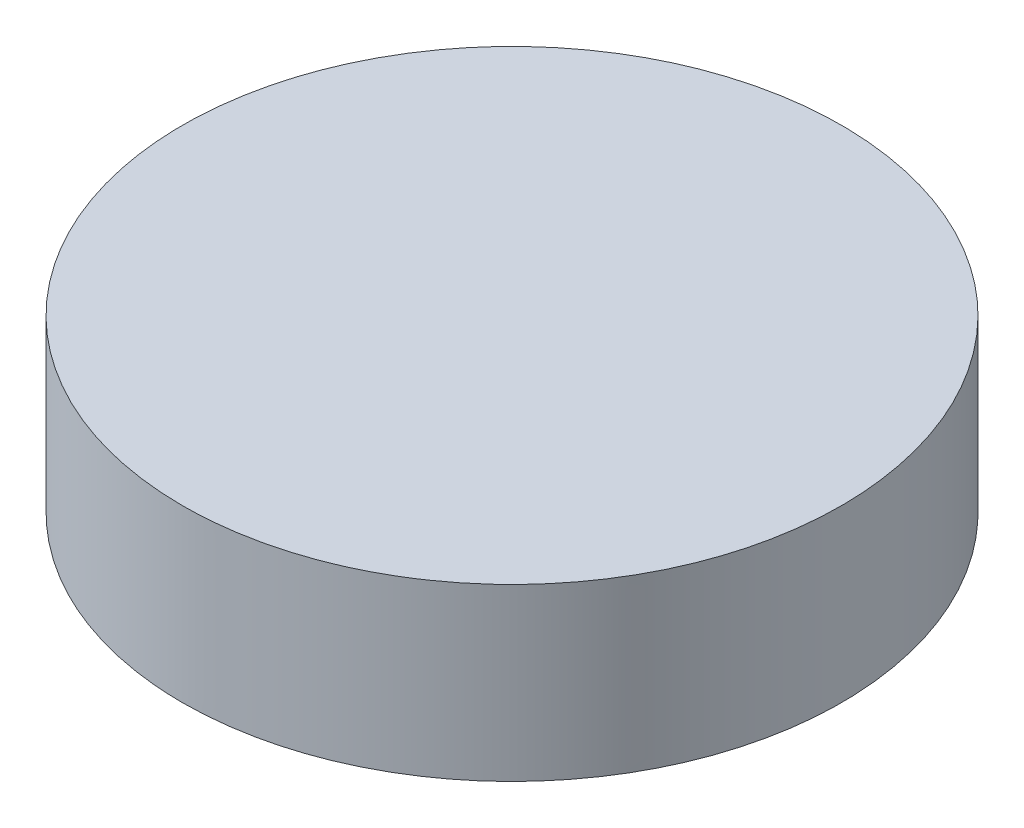
ISO-10303-21;
HEADER;
FILE_DESCRIPTION(('STEP AP214'),'2;1');
FILE_NAME('part.step','',(''),(''),'','','');
FILE_SCHEMA(('AUTOMOTIVE_DESIGN { 1 0 10303 214 1 1 1 1 }'));
ENDSEC;
DATA;
#1=APPLICATION_CONTEXT('core data for automotive mechanical design processes');
#2=APPLICATION_PROTOCOL_DEFINITION('international standard','automotive_design',2000,#1);
#3=PRODUCT_CONTEXT('',#1,'mechanical');
#4=PRODUCT('Part','Part','',(#3));
#5=PRODUCT_RELATED_PRODUCT_CATEGORY('part','',(#4));
#6=PRODUCT_DEFINITION_FORMATION('','',#4);
#7=PRODUCT_DEFINITION_CONTEXT('part definition',#1,'design');
#8=PRODUCT_DEFINITION('design','',#6,#7);
#9=PRODUCT_DEFINITION_SHAPE('','',#8);
#10=(LENGTH_UNIT() NAMED_UNIT(*) SI_UNIT(.MILLI.,.METRE.));
#11=(NAMED_UNIT(*) PLANE_ANGLE_UNIT() SI_UNIT($,.RADIAN.));
#12=(NAMED_UNIT(*) SI_UNIT($,.STERADIAN.) SOLID_ANGLE_UNIT());
#13=UNCERTAINTY_MEASURE_WITH_UNIT(LENGTH_MEASURE(1.E-05),#10,'distance_accuracy_value','');
#14=(GEOMETRIC_REPRESENTATION_CONTEXT(3) GLOBAL_UNCERTAINTY_ASSIGNED_CONTEXT((#13)) GLOBAL_UNIT_ASSIGNED_CONTEXT((#10,
#11,#12)) REPRESENTATION_CONTEXT('',''));
#15=CARTESIAN_POINT('',(0.,0.,0.));
#16=DIRECTION('',(0.,0.,1.));
#17=DIRECTION('',(1.,0.,0.));
#18=AXIS2_PLACEMENT_3D('',#15,#16,#17);
#19=CARTESIAN_POINT('',(-12.5,-2.7666312331574,1.28535533905933));
#20=CARTESIAN_POINT('',(-12.3317700207924,-2.7666312331574,1.28535533905933));
#21=CARTESIAN_POINT('',(-11.9953100623771,-2.7666312331574,1.21842929220248));
#22=CARTESIAN_POINT('',(-11.5674545927316,-2.7666312331574,0.932545407268426));
#23=CARTESIAN_POINT('',(-11.2815707077975,-2.7666312331574,0.504689937622919));
#24=CARTESIAN_POINT('',(-11.1811816375122,-2.7666312331574,0.));
#25=CARTESIAN_POINT('',(-11.2815707077975,-2.7666312331574,-0.504689937622919));
#26=CARTESIAN_POINT('',(-11.5674545927316,-2.7666312331574,-0.932545407268426));
#27=CARTESIAN_POINT('',(-11.9953100623771,-2.7666312331574,-1.21842929220248));
#28=CARTESIAN_POINT('',(-12.5,-2.7666312331574,-1.31881836248775));
#29=CARTESIAN_POINT('',(-13.0046899376229,-2.7666312331574,-1.21842929220248));
#30=CARTESIAN_POINT('',(-13.4325454072684,-2.7666312331574,-0.932545407268426));
#31=CARTESIAN_POINT('',(-13.7184292922025,-2.7666312331574,-0.50468993762292));
#32=CARTESIAN_POINT('',(-13.8188183624877,-2.7666312331574,0.));
#33=CARTESIAN_POINT('',(-13.7184292922025,-2.7666312331574,0.504689937622919));
#34=CARTESIAN_POINT('',(-13.4325454072684,-2.7666312331574,0.932545407268426));
#35=CARTESIAN_POINT('',(-13.0046899376229,-2.7666312331574,1.21842929220248));
#36=CARTESIAN_POINT('',(-12.6682299792076,-2.7666312331574,1.28535533905933));
#37=CARTESIAN_POINT('',(-12.5,-2.7666312331574,1.28535533905933));
#38=B_SPLINE_CURVE_WITH_KNOTS('',3,(#19,#20,#21,#22,#23,#24,#25,#26,#27,#28,#29,#30,#31,#32,#33,
#34,#35,#36,#37),.UNSPECIFIED.,.T.,.F.,(4,1,1,1,1,1,1,1,1,1,1,1,1,1,1,1,4),(0.,
0.0625000000000001,0.125,0.1875,0.25,0.3125,0.375,0.4375,0.5,0.5625,0.625,0.6875,0.75,0.8125,
0.875,0.9375,1.),.UNSPECIFIED.);
#39=DIRECTION('',(0.,1.,0.));
#40=VECTOR('',#39,1.);
#41=SURFACE_OF_LINEAR_EXTRUSION('',#38,#40);
#42=CARTESIAN_POINT('',(-12.5,-2.7666312331574,1.28535533905933));
#43=CARTESIAN_POINT('',(-12.3317700207924,-2.7666312331574,1.28535533905933));
#44=CARTESIAN_POINT('',(-11.9953100623771,-2.7666312331574,1.21842929220248));
#45=CARTESIAN_POINT('',(-11.5674545927316,-2.7666312331574,0.932545407268426));
#46=CARTESIAN_POINT('',(-11.2815707077975,-2.7666312331574,0.504689937622919));
#47=CARTESIAN_POINT('',(-11.1811816375122,-2.7666312331574,0.));
#48=CARTESIAN_POINT('',(-11.2815707077975,-2.7666312331574,-0.504689937622919));
#49=CARTESIAN_POINT('',(-11.5674545927316,-2.7666312331574,-0.932545407268426));
#50=CARTESIAN_POINT('',(-11.9953100623771,-2.7666312331574,-1.21842929220248));
#51=CARTESIAN_POINT('',(-12.5,-2.7666312331574,-1.31881836248775));
#52=CARTESIAN_POINT('',(-13.0046899376229,-2.7666312331574,-1.21842929220248));
#53=CARTESIAN_POINT('',(-13.4325454072684,-2.7666312331574,-0.932545407268426));
#54=CARTESIAN_POINT('',(-13.7184292922025,-2.7666312331574,-0.50468993762292));
#55=CARTESIAN_POINT('',(-13.8188183624877,-2.7666312331574,0.));
#56=CARTESIAN_POINT('',(-13.7184292922025,-2.7666312331574,0.504689937622919));
#57=CARTESIAN_POINT('',(-13.4325454072684,-2.7666312331574,0.932545407268426));
#58=CARTESIAN_POINT('',(-13.0046899376229,-2.7666312331574,1.21842929220248));
#59=CARTESIAN_POINT('',(-12.6682299792076,-2.7666312331574,1.28535533905933));
#60=CARTESIAN_POINT('',(-12.5,-2.7666312331574,1.28535533905933));
#61=B_SPLINE_CURVE_WITH_KNOTS('',3,(#42,#43,#44,#45,#46,#47,#48,#49,#50,#51,#52,#53,#54,#55,#56,
#57,#58,#59,#60),.UNSPECIFIED.,.T.,.F.,(4,1,1,1,1,1,1,1,1,1,1,1,1,1,1,1,4),(0.,
0.0625000000000001,0.125,0.1875,0.25,0.3125,0.375,0.4375,0.5,0.5625,0.625,0.6875,0.75,0.8125,
0.875,0.9375,1.),.UNSPECIFIED.);
#62=CARTESIAN_POINT('',(-12.5,-2.7666312331574,1.28535533905933));
#63=VERTEX_POINT('',#62);
#64=EDGE_CURVE('E9',#63,#63,#61,.T.);
#65=ORIENTED_EDGE('',*,*,#64,.T.);
#66=EDGE_LOOP('',(#65));
#67=FACE_BOUND('',#66,.T.);
#68=CARTESIAN_POINT('',(-12.5,-2.101,1.28535533905933));
#69=CARTESIAN_POINT('',(-12.5210292435893,-2.101,1.28535535428354));
#70=CARTESIAN_POINT('',(-12.5420580506909,-2.101,1.2848324564651));
#71=CARTESIAN_POINT('',(-12.5840656469514,-2.101,1.28275095206051));
#72=CARTESIAN_POINT('',(-12.605044433095,-2.101,1.28119228454248));
#73=CARTESIAN_POINT('',(-12.6469017924796,-2.101,1.27704921828212));
#74=CARTESIAN_POINT('',(-12.6677803587443,-2.101,1.2744647491513));
#75=CARTESIAN_POINT('',(-12.7093873858979,-2.101,1.26828002178174));
#76=CARTESIAN_POINT('',(-12.7301158402734,-2.101,1.26467971973334));
#77=CARTESIAN_POINT('',(-12.7713726611837,-2.101,1.25647322848943));
#78=CARTESIAN_POINT('',(-12.7919010277185,-2.101,1.25186703929392));
#79=CARTESIAN_POINT('',(-12.832707709252,-2.101,1.24165865806837));
#80=CARTESIAN_POINT('',(-12.8529860349978,-2.101,1.23605650900607));
#81=CARTESIAN_POINT('',(-12.8932426430212,-2.101,1.22386610104828));
#82=CARTESIAN_POINT('',(-12.9132209457939,-2.101,1.21727790985115));
#83=CARTESIAN_POINT('',(-12.9528275830444,-2.101,1.20312529881931));
#84=CARTESIAN_POINT('',(-12.9724559380415,-2.101,1.19556093643833));
#85=CARTESIAN_POINT('',(-13.0113124478785,-2.101,1.17946604308371));
#86=CARTESIAN_POINT('',(-13.0305406027184,-2.101,1.17093551211008));
#87=CARTESIAN_POINT('',(-13.06855413176,-2.101,1.15293679752466));
#88=CARTESIAN_POINT('',(-13.0873394798451,-2.101,1.14346855877762));
#89=CARTESIAN_POINT('',(-13.1244251203754,-2.101,1.12362275852903));
#90=CARTESIAN_POINT('',(-13.1427253794428,-2.101,1.11324513466535));
#91=CARTESIAN_POINT('',(-13.1787984767248,-2.101,1.09160886850265));
#92=CARTESIAN_POINT('',(-13.1965712921558,-2.101,1.08035018822159));
#93=CARTESIAN_POINT('',(-13.2315471338735,-2.101,1.05698007794264));
#94=CARTESIAN_POINT('',(-13.2487501601601,-2.101,1.04486864794475));
#95=CARTESIAN_POINT('',(-13.2825440403118,-2.101,1.0198212922901));
#96=CARTESIAN_POINT('',(-13.2991349205488,-2.101,1.00688540221767));
#97=CARTESIAN_POINT('',(-13.331662109414,-2.101,0.980217396939715));
#98=CARTESIAN_POINT('',(-13.3475984628843,-2.101,0.966485336436221));
#99=CARTESIAN_POINT('',(-13.3787742546724,-2.101,0.938253224868504));
#100=CARTESIAN_POINT('',(-13.3940137339342,-2.101,0.923753219032213));
#101=CARTESIAN_POINT('',(-13.4237532190322,-2.101,0.894013733934155));
#102=CARTESIAN_POINT('',(-13.4382532248685,-2.101,0.878774254672389));
#103=CARTESIAN_POINT('',(-13.4664853364362,-2.101,0.847598462884291));
#104=CARTESIAN_POINT('',(-13.4802173969397,-2.101,0.831662109414029));
#105=CARTESIAN_POINT('',(-13.5068854022177,-2.101,0.799134920548772));
#106=CARTESIAN_POINT('',(-13.5198212922901,-2.101,0.782544040311809));
#107=CARTESIAN_POINT('',(-13.5448686479447,-2.101,0.748750160160128));
#108=CARTESIAN_POINT('',(-13.5569800779426,-2.101,0.731547133873459));
#109=CARTESIAN_POINT('',(-13.5803501882216,-2.101,0.696571292155848));
#110=CARTESIAN_POINT('',(-13.5916088685027,-2.101,0.678798476724906));
#111=CARTESIAN_POINT('',(-13.6132451346653,-2.101,0.642725379442669));
#112=CARTESIAN_POINT('',(-13.623622758529,-2.101,0.624425120374889));
#113=CARTESIAN_POINT('',(-13.6434685587776,-2.101,0.587339479845542));
#114=CARTESIAN_POINT('',(-13.6529367975248,-2.101,0.568554131761774));
#115=CARTESIAN_POINT('',(-13.67093551211,-2.101,0.530540602716617));
#116=CARTESIAN_POINT('',(-13.6794660430833,-2.101,0.511312447871825));
#117=CARTESIAN_POINT('',(-13.6955609364387,-2.101,0.472455938048209));
#118=CARTESIAN_POINT('',(-13.7031252988208,-2.101,0.452827583069387));
#119=CARTESIAN_POINT('',(-13.7172779098496,-2.101,0.413220945768882));
#120=CARTESIAN_POINT('',(-13.7238661010426,-2.101,0.39324264292792));
#121=CARTESIAN_POINT('',(-13.7360565090117,-2.101,0.352986035091083));
#122=CARTESIAN_POINT('',(-13.7416586580894,-2.101,0.332707709600189));
#123=CARTESIAN_POINT('',(-13.7518670392729,-2.101,0.291901027370323));
#124=CARTESIAN_POINT('',(-13.7564732284109,-2.101,0.271372659884375));
#125=CARTESIAN_POINT('',(-13.7646797198118,-2.101,0.230115841572818));
#126=CARTESIAN_POINT('',(-13.7682800220747,-2.101,0.209387390747211));
#127=CARTESIAN_POINT('',(-13.7744647488584,-2.101,0.167780353895161));
#128=CARTESIAN_POINT('',(-13.7770492171889,-2.101,0.146901774382847));
#129=CARTESIAN_POINT('',(-13.7811922856357,-2.101,0.10504445119053));
#130=CARTESIAN_POINT('',(-13.7827509561402,-2.101,0.0840657144826372));
#131=CARTESIAN_POINT('',(-13.7848324523857,-2.101,0.0420579831636655));
#132=CARTESIAN_POINT('',(-13.7853553390593,-2.101,0.0210289915818326));
#133=CARTESIAN_POINT('',(-13.7853553390593,-2.101,-0.0210289915818331));
#134=CARTESIAN_POINT('',(-13.7848324523857,-2.101,-0.0420579831636659));
#135=CARTESIAN_POINT('',(-13.7827509561402,-2.101,-0.0840657144826377));
#136=CARTESIAN_POINT('',(-13.7811922856357,-2.101,-0.10504445119053));
#137=CARTESIAN_POINT('',(-13.7770492171889,-2.101,-0.146901774382848));
#138=CARTESIAN_POINT('',(-13.7744647488584,-2.101,-0.167780353895162));
#139=CARTESIAN_POINT('',(-13.7682800220747,-2.101,-0.209387390747211));
#140=CARTESIAN_POINT('',(-13.7646797198118,-2.101,-0.230115841572819));
#141=CARTESIAN_POINT('',(-13.7564732284109,-2.101,-0.271372659884376));
#142=CARTESIAN_POINT('',(-13.7518670392729,-2.101,-0.291901027370324));
#143=CARTESIAN_POINT('',(-13.7416586580894,-2.101,-0.33270770960019));
#144=CARTESIAN_POINT('',(-13.7360565090117,-2.101,-0.352986035091084));
#145=CARTESIAN_POINT('',(-13.7238661010426,-2.101,-0.393242642927921));
#146=CARTESIAN_POINT('',(-13.7172779098496,-2.101,-0.413220945768883));
#147=CARTESIAN_POINT('',(-13.7031252988208,-2.101,-0.452827583069388));
#148=CARTESIAN_POINT('',(-13.6955609364387,-2.101,-0.472455938048211));
#149=CARTESIAN_POINT('',(-13.6794660430833,-2.101,-0.511312447871826));
#150=CARTESIAN_POINT('',(-13.67093551211,-2.101,-0.530540602716618));
#151=CARTESIAN_POINT('',(-13.6529367975248,-2.101,-0.568554131761775));
#152=CARTESIAN_POINT('',(-13.6434685587776,-2.101,-0.587339479845544));
#153=CARTESIAN_POINT('',(-13.623622758529,-2.101,-0.624425120374891));
#154=CARTESIAN_POINT('',(-13.6132451346653,-2.101,-0.64272537944267));
#155=CARTESIAN_POINT('',(-13.5916088685027,-2.101,-0.678798476724906));
#156=CARTESIAN_POINT('',(-13.5803501882216,-2.101,-0.69657129215585));
#157=CARTESIAN_POINT('',(-13.5569800779426,-2.101,-0.731547133873461));
#158=CARTESIAN_POINT('',(-13.5448686479447,-2.101,-0.748750160160129));
#159=CARTESIAN_POINT('',(-13.5198212922901,-2.101,-0.78254404031181));
#160=CARTESIAN_POINT('',(-13.5068854022177,-2.101,-0.799134920548773));
#161=CARTESIAN_POINT('',(-13.4802173969397,-2.101,-0.83166210941403));
#162=CARTESIAN_POINT('',(-13.4664853364362,-2.101,-0.847598462884291));
#163=CARTESIAN_POINT('',(-13.4382532248685,-2.101,-0.87877425467239));
#164=CARTESIAN_POINT('',(-13.4237532190322,-2.101,-0.894013733934156));
#165=CARTESIAN_POINT('',(-13.3940137339342,-2.101,-0.923753219032213));
#166=CARTESIAN_POINT('',(-13.3787742546724,-2.101,-0.938253224868505));
#167=CARTESIAN_POINT('',(-13.3475984628843,-2.101,-0.966485336436221));
#168=CARTESIAN_POINT('',(-13.331662109414,-2.101,-0.980217396939716));
#169=CARTESIAN_POINT('',(-13.2991349205488,-2.101,-1.00688540221767));
#170=CARTESIAN_POINT('',(-13.2825440403118,-2.101,-1.0198212922901));
#171=CARTESIAN_POINT('',(-13.2487501601601,-2.101,-1.04486864794475));
#172=CARTESIAN_POINT('',(-13.2315471338735,-2.101,-1.05698007794264));
#173=CARTESIAN_POINT('',(-13.1965712921558,-2.101,-1.08035018822159));
#174=CARTESIAN_POINT('',(-13.1787984767249,-2.101,-1.09160886850266));
#175=CARTESIAN_POINT('',(-13.1427253794427,-2.101,-1.11324513466535));
#176=CARTESIAN_POINT('',(-13.1244251203749,-2.101,-1.12362275852901));
#177=CARTESIAN_POINT('',(-13.0873394798455,-2.101,-1.14346855877765));
#178=CARTESIAN_POINT('',(-13.0685541317618,-2.101,-1.15293679752477));
#179=CARTESIAN_POINT('',(-13.0305406027166,-2.101,-1.17093551210997));
#180=CARTESIAN_POINT('',(-13.0113124478718,-2.101,-1.17946604308331));
#181=CARTESIAN_POINT('',(-12.9724559380482,-2.101,-1.19556093643873));
#182=CARTESIAN_POINT('',(-12.9528275830694,-2.101,-1.20312529882082));
#183=CARTESIAN_POINT('',(-12.9132209457689,-2.101,-1.21727790984964));
#184=CARTESIAN_POINT('',(-12.8932426429279,-2.101,-1.22386610104265));
#185=CARTESIAN_POINT('',(-12.8529860350911,-2.101,-1.23605650901171));
#186=CARTESIAN_POINT('',(-12.8327077096002,-2.101,-1.24165865808941));
#187=CARTESIAN_POINT('',(-12.7919010273703,-2.101,-1.25186703927288));
#188=CARTESIAN_POINT('',(-12.7713726598844,-2.101,-1.25647322841093));
#189=CARTESIAN_POINT('',(-12.7301158415728,-2.101,-1.26467971981183));
#190=CARTESIAN_POINT('',(-12.7093873907472,-2.101,-1.26828002207469));
#191=CARTESIAN_POINT('',(-12.6677803538952,-2.101,-1.27446474885836));
#192=CARTESIAN_POINT('',(-12.6469017743828,-2.101,-1.27704921718887));
#193=CARTESIAN_POINT('',(-12.6050444511905,-2.101,-1.28119228563567));
#194=CARTESIAN_POINT('',(-12.5840657144826,-2.101,-1.28275095614019));
#195=CARTESIAN_POINT('',(-12.5420579831637,-2.101,-1.28483245238567));
#196=CARTESIAN_POINT('',(-12.5210289915818,-2.101,-1.28535533905933));
#197=CARTESIAN_POINT('',(-12.4789710084182,-2.101,-1.28535533905933));
#198=CARTESIAN_POINT('',(-12.4579420168363,-2.101,-1.28483245238567));
#199=CARTESIAN_POINT('',(-12.4159342855174,-2.101,-1.28275095614019));
#200=CARTESIAN_POINT('',(-12.3949555488095,-2.101,-1.28119228563567));
#201=CARTESIAN_POINT('',(-12.3530982256172,-2.101,-1.27704921718887));
#202=CARTESIAN_POINT('',(-12.3322196461048,-2.101,-1.27446474885836));
#203=CARTESIAN_POINT('',(-12.2906126092528,-2.101,-1.26828002207469));
#204=CARTESIAN_POINT('',(-12.2698841584272,-2.101,-1.26467971981183));
#205=CARTESIAN_POINT('',(-12.2286273401156,-2.101,-1.25647322841093));
#206=CARTESIAN_POINT('',(-12.2080989726297,-2.101,-1.25186703927288));
#207=CARTESIAN_POINT('',(-12.1672922903998,-2.101,-1.24165865808941));
#208=CARTESIAN_POINT('',(-12.1470139649089,-2.101,-1.23605650901171));
#209=CARTESIAN_POINT('',(-12.1067573570721,-2.101,-1.22386610104265));
#210=CARTESIAN_POINT('',(-12.0867790542311,-2.101,-1.21727790984964));
#211=CARTESIAN_POINT('',(-12.0471724169306,-2.101,-1.20312529882082));
#212=CARTESIAN_POINT('',(-12.0275440619518,-2.101,-1.19556093643873));
#213=CARTESIAN_POINT('',(-11.9886875521282,-2.101,-1.17946604308331));
#214=CARTESIAN_POINT('',(-11.9694593972834,-2.101,-1.17093551210997));
#215=CARTESIAN_POINT('',(-11.9314458682382,-2.101,-1.15293679752477));
#216=CARTESIAN_POINT('',(-11.9126605201545,-2.101,-1.14346855877765));
#217=CARTESIAN_POINT('',(-11.8755748796251,-2.101,-1.123622758529));
#218=CARTESIAN_POINT('',(-11.8572746205573,-2.101,-1.11324513466535));
#219=CARTESIAN_POINT('',(-11.8212015232751,-2.101,-1.09160886850266));
#220=CARTESIAN_POINT('',(-11.8034287078441,-2.101,-1.08035018822159));
#221=CARTESIAN_POINT('',(-11.7684528661265,-2.101,-1.05698007794264));
#222=CARTESIAN_POINT('',(-11.7512498398399,-2.101,-1.04486864794475));
#223=CARTESIAN_POINT('',(-11.7174559596882,-2.101,-1.0198212922901));
#224=CARTESIAN_POINT('',(-11.7008650794512,-2.101,-1.00688540221767));
#225=CARTESIAN_POINT('',(-11.668337890586,-2.101,-0.980217396939715));
#226=CARTESIAN_POINT('',(-11.6524015371157,-2.101,-0.966485336436221));
#227=CARTESIAN_POINT('',(-11.6212257453276,-2.101,-0.938253224868504));
#228=CARTESIAN_POINT('',(-11.6059862660658,-2.101,-0.923753219032213));
#229=CARTESIAN_POINT('',(-11.5762467809678,-2.101,-0.894013733934155));
#230=CARTESIAN_POINT('',(-11.5617467751315,-2.101,-0.878774254672389));
#231=CARTESIAN_POINT('',(-11.5335146635638,-2.101,-0.84759846288429));
#232=CARTESIAN_POINT('',(-11.5197826030603,-2.101,-0.831662109414029));
#233=CARTESIAN_POINT('',(-11.4931145977823,-2.101,-0.799134920548772));
#234=CARTESIAN_POINT('',(-11.4801787077099,-2.101,-0.782544040311809));
#235=CARTESIAN_POINT('',(-11.4551313520553,-2.101,-0.748750160160128));
#236=CARTESIAN_POINT('',(-11.4430199220574,-2.101,-0.73154713387346));
#237=CARTESIAN_POINT('',(-11.4196498117784,-2.101,-0.696571292155849));
#238=CARTESIAN_POINT('',(-11.4083911314973,-2.101,-0.678798476724905));
#239=CARTESIAN_POINT('',(-11.3867548653347,-2.101,-0.642725379442669));
#240=CARTESIAN_POINT('',(-11.376377241471,-2.101,-0.62442512037489));
#241=CARTESIAN_POINT('',(-11.3565314412223,-2.101,-0.587339479845543));
#242=CARTESIAN_POINT('',(-11.3470632024752,-2.101,-0.568554131761774));
#243=CARTESIAN_POINT('',(-11.32906448789,-2.101,-0.530540602716617));
#244=CARTESIAN_POINT('',(-11.3205339569167,-2.101,-0.511312447871824));
#245=CARTESIAN_POINT('',(-11.3044390635613,-2.101,-0.472455938048209));
#246=CARTESIAN_POINT('',(-11.2968747011792,-2.101,-0.452827583069387));
#247=CARTESIAN_POINT('',(-11.2827220901504,-2.101,-0.413220945768882));
#248=CARTESIAN_POINT('',(-11.2761338989574,-2.101,-0.39324264292792));
#249=CARTESIAN_POINT('',(-11.2639434909883,-2.101,-0.352986035091083));
#250=CARTESIAN_POINT('',(-11.2583413419106,-2.101,-0.332707709600189));
#251=CARTESIAN_POINT('',(-11.2481329607271,-2.101,-0.291901027370323));
#252=CARTESIAN_POINT('',(-11.2435267715891,-2.101,-0.271372659884375));
#253=CARTESIAN_POINT('',(-11.2353202801882,-2.101,-0.230115841572818));
#254=CARTESIAN_POINT('',(-11.2317199779253,-2.101,-0.209387390747211));
#255=CARTESIAN_POINT('',(-11.2255352511416,-2.101,-0.167780353895161));
#256=CARTESIAN_POINT('',(-11.2229507828111,-2.101,-0.146901774382847));
#257=CARTESIAN_POINT('',(-11.2188077143643,-2.101,-0.105044451190529));
#258=CARTESIAN_POINT('',(-11.2172490438598,-2.101,-0.0840657144826369));
#259=CARTESIAN_POINT('',(-11.2151675476143,-2.101,-0.0420579831636654));
#260=CARTESIAN_POINT('',(-11.2146446609407,-2.101,-0.0210289915818325));
#261=CARTESIAN_POINT('',(-11.2146446609407,-2.101,0.0210289915818333));
#262=CARTESIAN_POINT('',(-11.2151675476143,-2.101,0.0420579831636662));
#263=CARTESIAN_POINT('',(-11.2172490438598,-2.101,0.0840657144826378));
#264=CARTESIAN_POINT('',(-11.2188077143643,-2.101,0.10504445119053));
#265=CARTESIAN_POINT('',(-11.2229507828111,-2.101,0.146901774382848));
#266=CARTESIAN_POINT('',(-11.2255352511416,-2.101,0.167780353895162));
#267=CARTESIAN_POINT('',(-11.2317199779253,-2.101,0.209387390747211));
#268=CARTESIAN_POINT('',(-11.2353202801882,-2.101,0.230115841572819));
#269=CARTESIAN_POINT('',(-11.2435267715891,-2.101,0.271372659884375));
#270=CARTESIAN_POINT('',(-11.2481329607271,-2.101,0.291901027370323));
#271=CARTESIAN_POINT('',(-11.2583413419106,-2.101,0.33270770960019));
#272=CARTESIAN_POINT('',(-11.2639434909883,-2.101,0.352986035091083));
#273=CARTESIAN_POINT('',(-11.2761338989574,-2.101,0.393242642927921));
#274=CARTESIAN_POINT('',(-11.2827220901504,-2.101,0.413220945768883));
#275=CARTESIAN_POINT('',(-11.2968747011792,-2.101,0.452827583069388));
#276=CARTESIAN_POINT('',(-11.3044390635613,-2.101,0.47245593804821));
#277=CARTESIAN_POINT('',(-11.3205339569167,-2.101,0.511312447871825));
#278=CARTESIAN_POINT('',(-11.32906448789,-2.101,0.530540602716618));
#279=CARTESIAN_POINT('',(-11.3470632024752,-2.101,0.568554131761775));
#280=CARTESIAN_POINT('',(-11.3565314412223,-2.101,0.587339479845543));
#281=CARTESIAN_POINT('',(-11.376377241471,-2.101,0.62442512037489));
#282=CARTESIAN_POINT('',(-11.3867548653347,-2.101,0.642725379442669));
#283=CARTESIAN_POINT('',(-11.4083911314973,-2.101,0.678798476724906));
#284=CARTESIAN_POINT('',(-11.4196498117784,-2.101,0.696571292155849));
#285=CARTESIAN_POINT('',(-11.4430199220574,-2.101,0.73154713387346));
#286=CARTESIAN_POINT('',(-11.4551313520553,-2.101,0.748750160160128));
#287=CARTESIAN_POINT('',(-11.4801787077099,-2.101,0.782544040311809));
#288=CARTESIAN_POINT('',(-11.4931145977823,-2.101,0.799134920548772));
#289=CARTESIAN_POINT('',(-11.5197826030603,-2.101,0.831662109414029));
#290=CARTESIAN_POINT('',(-11.5335146635638,-2.101,0.847598462884291));
#291=CARTESIAN_POINT('',(-11.5617467751315,-2.101,0.878774254672389));
#292=CARTESIAN_POINT('',(-11.5762467809678,-2.101,0.894013733934155));
#293=CARTESIAN_POINT('',(-11.6059862660658,-2.101,0.923753219032213));
#294=CARTESIAN_POINT('',(-11.6212257453276,-2.101,0.938253224868505));
#295=CARTESIAN_POINT('',(-11.6524015371157,-2.101,0.966485336436221));
#296=CARTESIAN_POINT('',(-11.668337890586,-2.101,0.980217396939716));
#297=CARTESIAN_POINT('',(-11.7008650794512,-2.101,1.00688540221767));
#298=CARTESIAN_POINT('',(-11.7174559596882,-2.101,1.0198212922901));
#299=CARTESIAN_POINT('',(-11.7512498398399,-2.101,1.04486864794475));
#300=CARTESIAN_POINT('',(-11.7684528661265,-2.101,1.05698007794264));
#301=CARTESIAN_POINT('',(-11.8034287078442,-2.101,1.08035018822159));
#302=CARTESIAN_POINT('',(-11.8212015232752,-2.101,1.09160886850265));
#303=CARTESIAN_POINT('',(-11.8572746205572,-2.101,1.11324513466535));
#304=CARTESIAN_POINT('',(-11.8755748796246,-2.101,1.12362275852903));
#305=CARTESIAN_POINT('',(-11.9126605201549,-2.101,1.14346855877762));
#306=CARTESIAN_POINT('',(-11.93144586824,-2.101,1.15293679752466));
#307=CARTESIAN_POINT('',(-11.9694593972816,-2.101,1.17093551211008));
#308=CARTESIAN_POINT('',(-11.9886875521215,-2.101,1.17946604308371));
#309=CARTESIAN_POINT('',(-12.0275440619585,-2.101,1.19556093643833));
#310=CARTESIAN_POINT('',(-12.0471724169556,-2.101,1.20312529881931));
#311=CARTESIAN_POINT('',(-12.0867790542061,-2.101,1.21727790985115));
#312=CARTESIAN_POINT('',(-12.1067573569788,-2.101,1.22386610104828));
#313=CARTESIAN_POINT('',(-12.1470139650022,-2.101,1.23605650900607));
#314=CARTESIAN_POINT('',(-12.167292290748,-2.101,1.24165865806837));
#315=CARTESIAN_POINT('',(-12.2080989722815,-2.101,1.25186703929392));
#316=CARTESIAN_POINT('',(-12.2286273388163,-2.101,1.25647322848943));
#317=CARTESIAN_POINT('',(-12.2698841597265,-2.101,1.26467971973334));
#318=CARTESIAN_POINT('',(-12.2906126141021,-2.101,1.26828002178174));
#319=CARTESIAN_POINT('',(-12.3322196412557,-2.101,1.2744647491513));
#320=CARTESIAN_POINT('',(-12.3530982075204,-2.101,1.27704921828212));
#321=CARTESIAN_POINT('',(-12.394955566905,-2.101,1.28119228454249));
#322=CARTESIAN_POINT('',(-12.4159343530485,-2.101,1.28275095206051));
#323=CARTESIAN_POINT('',(-12.4579419493091,-2.101,1.2848324564651));
#324=CARTESIAN_POINT('',(-12.4789707564107,-2.101,1.28535535428354));
#325=CARTESIAN_POINT('',(-12.5,-2.101,1.28535533905933));
#326=B_SPLINE_CURVE_WITH_KNOTS('',3,(#68,#69,#70,#71,#72,#73,#74,#75,#76,#77,#78,#79,#80,#81,
#82,#83,#84,#85,#86,#87,#88,#89,#90,#91,#92,#93,#94,#95,#96,#97,#98,#99,#100,#101,#102,#103,
#104,#105,#106,#107,#108,#109,#110,#111,#112,#113,#114,#115,#116,#117,#118,#119,#120,#121,#122,
#123,#124,#125,#126,#127,#128,#129,#130,#131,#132,#133,#134,#135,#136,#137,#138,#139,#140,#141,
#142,#143,#144,#145,#146,#147,#148,#149,#150,#151,#152,#153,#154,#155,#156,#157,#158,#159,#160,
#161,#162,#163,#164,#165,#166,#167,#168,#169,#170,#171,#172,#173,#174,#175,#176,#177,#178,#179,
#180,#181,#182,#183,#184,#185,#186,#187,#188,#189,#190,#191,#192,#193,#194,#195,#196,#197,#198,
#199,#200,#201,#202,#203,#204,#205,#206,#207,#208,#209,#210,#211,#212,#213,#214,#215,#216,#217,
#218,#219,#220,#221,#222,#223,#224,#225,#226,#227,#228,#229,#230,#231,#232,#233,#234,#235,#236,
#237,#238,#239,#240,#241,#242,#243,#244,#245,#246,#247,#248,#249,#250,#251,#252,#253,#254,#255,
#256,#257,#258,#259,#260,#261,#262,#263,#264,#265,#266,#267,#268,#269,#270,#271,#272,#273,#274,
#275,#276,#277,#278,#279,#280,#281,#282,#283,#284,#285,#286,#287,#288,#289,#290,#291,#292,#293,
#294,#295,#296,#297,#298,#299,#300,#301,#302,#303,#304,#305,#306,#307,#308,#309,#310,#311,#312,
#313,#314,#315,#316,#317,#318,#319,#320,#321,#322,#323,#324,#325),.UNSPECIFIED.,.F.,.F.,(4,2,2,
2,2,2,2,2,2,2,2,2,2,2,2,2,2,2,2,2,2,2,2,2,2,2,2,2,2,2,2,2,2,2,2,2,2,2,2,2,2,2,2,2,2,2,2,2,2,2,2,
2,2,2,2,2,2,2,2,2,2,2,2,2,2,2,2,2,2,2,2,2,2,2,2,2,2,2,2,2,2,2,2,2,2,2,2,2,2,2,2,2,2,2,2,2,2,2,2,
2,2,2,2,2,2,2,2,2,2,2,2,2,2,2,2,2,2,2,2,2,2,2,2,2,2,2,2,2,4),(0.,0.0630806127990758,
0.12616493680959,0.189253590290848,0.252344965001654,0.315436339712461,0.378524993193721,
0.441609317204232,0.504689930003312,0.567770542802388,0.6308548668129,0.693943520294158,
0.757034895004962,0.82012626971577,0.883214923197029,0.946299247207541,1.00937986000662,
1.0724604728057,1.13554479681621,1.19863345029747,1.26172482500827,1.32481619971908,
1.38790485320034,1.45098917721085,1.51406979000993,1.57715040280901,1.64023472681952,
1.70332338030078,1.76641475501158,1.82950612972239,1.89259478320365,1.95567910721416,
2.01875972001324,2.08184033281232,2.14492465682283,2.20801331030409,2.27110468501489,
2.3341960597257,2.39728471320696,2.46036903721747,2.52344965001655,2.58653026281563,
2.64961458682614,2.7127032403074,2.7757946150182,2.83888598972901,2.90197464321027,
2.96505896722078,3.02813958001986,3.09122019281893,3.15430451682944,3.2173931703107,
3.28048454502151,3.34357591973231,3.40666457321357,3.46974889722409,3.53282951002316,
3.59591012282224,3.65899444683275,3.72208310031401,3.78517447502482,3.84826584973563,
3.91135450321688,3.9744388272274,4.03751944002647,4.10060005282555,4.16368437683606,
4.22677303031732,4.28986440502813,4.35295577973894,4.4160444332202,4.47912875723071,
4.54220937002979,4.60528998282887,4.66837430683938,4.73146296032063,4.79455433503144,
4.85764570974225,4.9207343632235,4.98381868723402,5.04689930003309,5.10997991283217,
5.17306423684268,5.23615289032394,5.29924426503475,5.36233563974555,5.42542429322681,
5.48850861723732,5.5515892300364,5.61466984283548,5.67775416684599,5.74084282032725,
5.80393419503806,5.86702556974886,5.93011422323012,5.99319854724063,6.05627916003971,
6.11935977283879,6.1824440968493,6.24553275033056,6.30862412504136,6.37171549975217,
6.43480415323343,6.49788847724394,6.56096909004302,6.6240497028421,6.68713402685261,
6.75022268033387,6.81331405504467,6.87640542975548,6.93949408323674,7.00257840724725,
7.06565902004633,7.12873963284541,7.19182395685592,7.25491261033718,7.31800398504799,
7.38109535975879,7.44418401324005,7.50726833725056,7.57034895004964,7.63342956284872,
7.69651388685923,7.75960254034049,7.82269391505129,7.8857852897621,7.94887394324336,
8.01195826725387,8.07503888005295),.UNSPECIFIED.);
#327=CARTESIAN_POINT('',(-12.5,-2.101,1.28535533905933));
#328=VERTEX_POINT('',#327);
#329=EDGE_CURVE('E24',#328,#328,#326,.F.);
#330=ORIENTED_EDGE('',*,*,#329,.F.);
#331=EDGE_LOOP('',(#330));
#332=FACE_BOUND('',#331,.T.);
#333=ADVANCED_FACE('F14',(#67,#332),#41,.T.);
#334=CARTESIAN_POINT('',(-3.5,-2.7666312331574,0.));
#335=DIRECTION('',(0.,1.,0.));
#336=DIRECTION('',(-1.,0.,0.));
#337=AXIS2_PLACEMENT_3D('',#334,#335,#336);
#338=PLANE('',#337);
#339=ORIENTED_EDGE('',*,*,#64,.F.);
#340=EDGE_LOOP('',(#339));
#341=FACE_BOUND('',#340,.T.);
#342=ADVANCED_FACE('F62',(#341),#338,.F.);
#343=CARTESIAN_POINT('',(-3.5,-2.101,0.));
#344=DIRECTION('',(0.,1.,0.));
#345=DIRECTION('',(-1.,0.,0.));
#346=AXIS2_PLACEMENT_3D('',#343,#344,#345);
#347=PLANE('',#346);
#348=ORIENTED_EDGE('',*,*,#329,.T.);
#349=EDGE_LOOP('',(#348));
#350=FACE_BOUND('',#349,.T.);
#351=ADVANCED_FACE('F31',(#350),#347,.T.);
#352=CLOSED_SHELL('',(#333,#342,#351));
#353=MANIFOLD_SOLID_BREP('B1',#352);
#354=ADVANCED_BREP_SHAPE_REPRESENTATION('',(#18,#353),#14);
#355=SHAPE_DEFINITION_REPRESENTATION(#9,#354);
ENDSEC;
END-ISO-10303-21;
